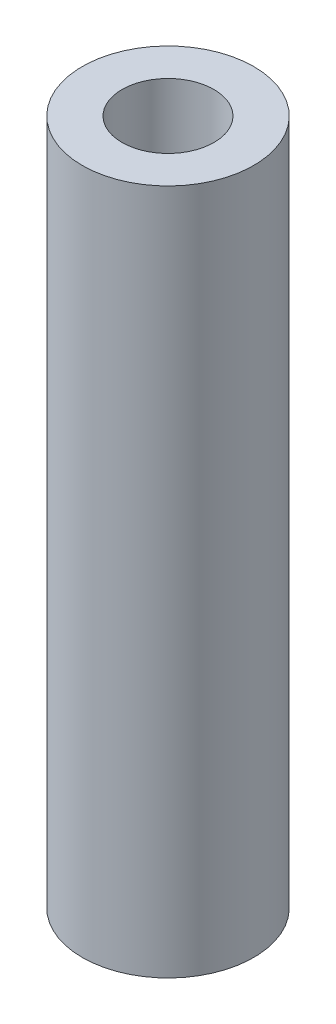
ISO-10303-21;
HEADER;
FILE_DESCRIPTION(('STEP AP214'),'2;1');
FILE_NAME('part.step','',(''),(''),'','','');
FILE_SCHEMA(('AUTOMOTIVE_DESIGN { 1 0 10303 214 1 1 1 1 }'));
ENDSEC;
DATA;
#1=APPLICATION_CONTEXT('core data for automotive mechanical design processes');
#2=APPLICATION_PROTOCOL_DEFINITION('international standard','automotive_design',2000,#1);
#3=PRODUCT_CONTEXT('',#1,'mechanical');
#4=PRODUCT('Part','Part','',(#3));
#5=PRODUCT_RELATED_PRODUCT_CATEGORY('part','',(#4));
#6=PRODUCT_DEFINITION_FORMATION('','',#4);
#7=PRODUCT_DEFINITION_CONTEXT('part definition',#1,'design');
#8=PRODUCT_DEFINITION('design','',#6,#7);
#9=PRODUCT_DEFINITION_SHAPE('','',#8);
#10=(LENGTH_UNIT() NAMED_UNIT(*) SI_UNIT(.MILLI.,.METRE.));
#11=(NAMED_UNIT(*) PLANE_ANGLE_UNIT() SI_UNIT($,.RADIAN.));
#12=(NAMED_UNIT(*) SI_UNIT($,.STERADIAN.) SOLID_ANGLE_UNIT());
#13=UNCERTAINTY_MEASURE_WITH_UNIT(LENGTH_MEASURE(1.E-05),#10,'distance_accuracy_value','');
#14=(GEOMETRIC_REPRESENTATION_CONTEXT(3) GLOBAL_UNCERTAINTY_ASSIGNED_CONTEXT((#13)) GLOBAL_UNIT_ASSIGNED_CONTEXT((#10,
#11,#12)) REPRESENTATION_CONTEXT('',''));
#15=CARTESIAN_POINT('',(0.,0.,0.));
#16=DIRECTION('',(0.,0.,1.));
#17=DIRECTION('',(1.,0.,0.));
#18=AXIS2_PLACEMENT_3D('',#15,#16,#17);
#19=CARTESIAN_POINT('',(0.,25.4,0.));
#20=DIRECTION('',(0.,1.,0.));
#21=DIRECTION('',(0.,0.,1.));
#22=AXIS2_PLACEMENT_3D('',#19,#20,#21);
#23=PLANE('',#22);
#24=CARTESIAN_POINT('',(0.,25.4,0.));
#25=DIRECTION('',(0.,1.,0.));
#26=DIRECTION('',(0.,0.,1.));
#27=AXIS2_PLACEMENT_3D('',#24,#25,#26);
#28=CIRCLE('',#27,3.175);
#29=CARTESIAN_POINT('',(0.,25.4,3.175));
#30=VERTEX_POINT('',#29);
#31=EDGE_CURVE('E10',#30,#30,#28,.T.);
#32=ORIENTED_EDGE('',*,*,#31,.T.);
#33=EDGE_LOOP('',(#32));
#34=FACE_BOUND('',#33,.T.);
#35=CARTESIAN_POINT('',(0.,25.4,0.));
#36=DIRECTION('',(0.,1.,0.));
#37=DIRECTION('',(0.,0.,1.));
#38=AXIS2_PLACEMENT_3D('',#35,#36,#37);
#39=CIRCLE('',#38,1.7018);
#40=CARTESIAN_POINT('',(0.,25.4,1.7018));
#41=VERTEX_POINT('',#40);
#42=EDGE_CURVE('E369',#41,#41,#39,.T.);
#43=ORIENTED_EDGE('',*,*,#42,.F.);
#44=EDGE_LOOP('',(#43));
#45=FACE_BOUND('',#44,.T.);
#46=ADVANCED_FACE('F358',(#34,#45),#23,.T.);
#47=CARTESIAN_POINT('',(0.,0.,0.));
#48=DIRECTION('',(0.,1.,0.));
#49=DIRECTION('',(0.,0.,1.));
#50=AXIS2_PLACEMENT_3D('',#47,#48,#49);
#51=PLANE('',#50);
#52=CARTESIAN_POINT('',(0.,0.,0.));
#53=DIRECTION('',(0.,1.,0.));
#54=DIRECTION('',(0.,0.,1.));
#55=AXIS2_PLACEMENT_3D('',#52,#53,#54);
#56=CIRCLE('',#55,3.175);
#57=CARTESIAN_POINT('',(0.,0.,3.175));
#58=VERTEX_POINT('',#57);
#59=EDGE_CURVE('E365',#58,#58,#56,.T.);
#60=ORIENTED_EDGE('',*,*,#59,.F.);
#61=EDGE_LOOP('',(#60));
#62=FACE_BOUND('',#61,.T.);
#63=CARTESIAN_POINT('',(0.,0.,0.));
#64=DIRECTION('',(0.,1.,0.));
#65=DIRECTION('',(0.,0.,1.));
#66=AXIS2_PLACEMENT_3D('',#63,#64,#65);
#67=CIRCLE('',#66,1.7018);
#68=CARTESIAN_POINT('',(0.,0.,1.7018));
#69=VERTEX_POINT('',#68);
#70=EDGE_CURVE('E373',#69,#69,#67,.T.);
#71=ORIENTED_EDGE('',*,*,#70,.T.);
#72=EDGE_LOOP('',(#71));
#73=FACE_BOUND('',#72,.T.);
#74=ADVANCED_FACE('F379',(#62,#73),#51,.F.);
#75=CARTESIAN_POINT('',(0.,25.4,0.));
#76=DIRECTION('',(0.,-1.,0.));
#77=DIRECTION('',(0.,0.,-1.));
#78=AXIS2_PLACEMENT_3D('',#75,#76,#77);
#79=CYLINDRICAL_SURFACE('',#78,3.175);
#80=ORIENTED_EDGE('',*,*,#31,.F.);
#81=EDGE_LOOP('',(#80));
#82=FACE_BOUND('',#81,.T.);
#83=ORIENTED_EDGE('',*,*,#59,.T.);
#84=EDGE_LOOP('',(#83));
#85=FACE_BOUND('',#84,.T.);
#86=ADVANCED_FACE('F360',(#82,#85),#79,.T.);
#87=CARTESIAN_POINT('',(0.,25.4,0.));
#88=DIRECTION('',(0.,-1.,0.));
#89=DIRECTION('',(0.,0.,-1.));
#90=AXIS2_PLACEMENT_3D('',#87,#88,#89);
#91=CYLINDRICAL_SURFACE('',#90,1.7018);
#92=ORIENTED_EDGE('',*,*,#42,.T.);
#93=EDGE_LOOP('',(#92));
#94=FACE_BOUND('',#93,.T.);
#95=ORIENTED_EDGE('',*,*,#70,.F.);
#96=EDGE_LOOP('',(#95));
#97=FACE_BOUND('',#96,.T.);
#98=ADVANCED_FACE('F381',(#94,#97),#91,.F.);
#99=CLOSED_SHELL('',(#46,#74,#86,#98));
#100=MANIFOLD_SOLID_BREP('B2',#99);
#101=ADVANCED_BREP_SHAPE_REPRESENTATION('',(#18,#100),#14);
#102=SHAPE_DEFINITION_REPRESENTATION(#9,#101);
ENDSEC;
END-ISO-10303-21;
